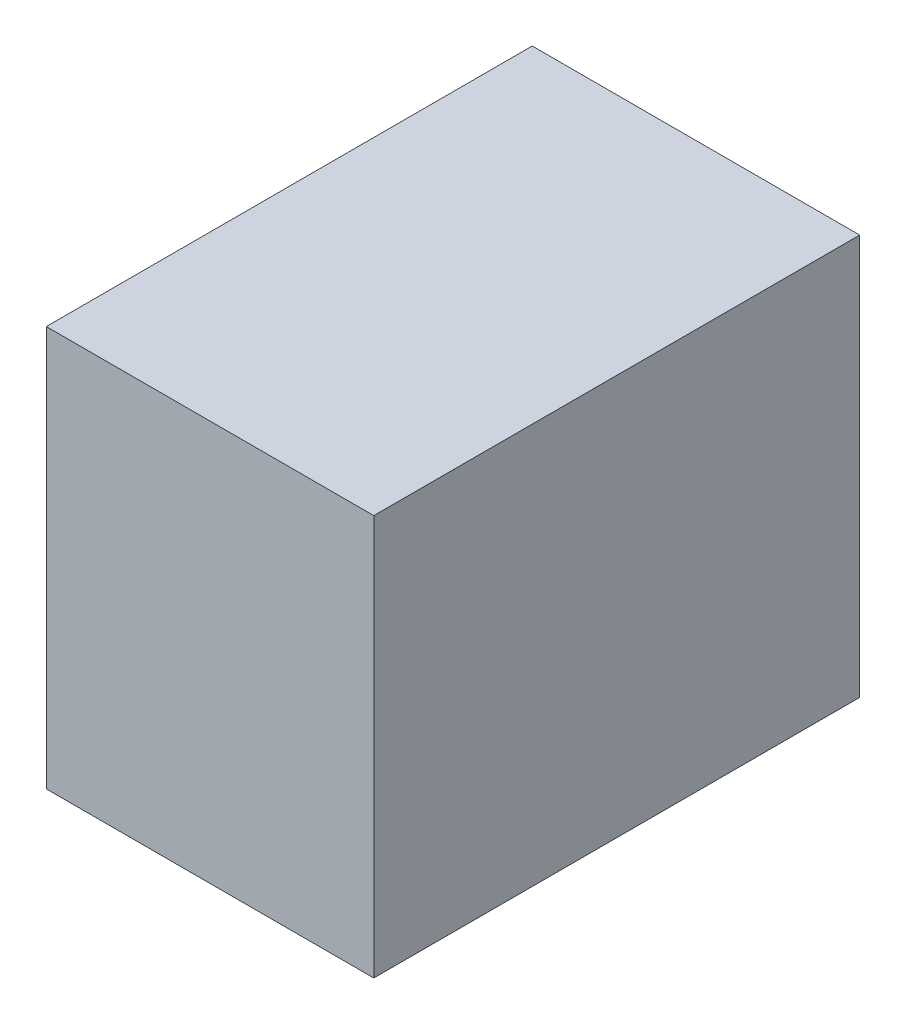
ISO-10303-21;
HEADER;
FILE_DESCRIPTION(('STEP AP214'),'2;1');
FILE_NAME('part.step','',(''),(''),'','','');
FILE_SCHEMA(('AUTOMOTIVE_DESIGN { 1 0 10303 214 1 1 1 1 }'));
ENDSEC;
DATA;
#1=APPLICATION_CONTEXT('core data for automotive mechanical design processes');
#2=APPLICATION_PROTOCOL_DEFINITION('international standard','automotive_design',2000,#1);
#3=PRODUCT_CONTEXT('',#1,'mechanical');
#4=PRODUCT('Part','Part','',(#3));
#5=PRODUCT_RELATED_PRODUCT_CATEGORY('part','',(#4));
#6=PRODUCT_DEFINITION_FORMATION('','',#4);
#7=PRODUCT_DEFINITION_CONTEXT('part definition',#1,'design');
#8=PRODUCT_DEFINITION('design','',#6,#7);
#9=PRODUCT_DEFINITION_SHAPE('','',#8);
#10=(LENGTH_UNIT() NAMED_UNIT(*) SI_UNIT(.MILLI.,.METRE.));
#11=(NAMED_UNIT(*) PLANE_ANGLE_UNIT() SI_UNIT($,.RADIAN.));
#12=(NAMED_UNIT(*) SI_UNIT($,.STERADIAN.) SOLID_ANGLE_UNIT());
#13=UNCERTAINTY_MEASURE_WITH_UNIT(LENGTH_MEASURE(1.E-05),#10,'distance_accuracy_value','');
#14=(GEOMETRIC_REPRESENTATION_CONTEXT(3) GLOBAL_UNCERTAINTY_ASSIGNED_CONTEXT((#13)) GLOBAL_UNIT_ASSIGNED_CONTEXT((#10,
#11,#12)) REPRESENTATION_CONTEXT('',''));
#15=CARTESIAN_POINT('',(0.,0.,0.));
#16=DIRECTION('',(0.,0.,1.));
#17=DIRECTION('',(1.,0.,0.));
#18=AXIS2_PLACEMENT_3D('',#15,#16,#17);
#19=CARTESIAN_POINT('',(-444.5,1087.12,659.60625));
#20=DIRECTION('',(1.,0.,0.));
#21=DIRECTION('',(0.,0.,-1.));
#22=AXIS2_PLACEMENT_3D('',#19,#20,#21);
#23=PLANE('',#22);
#24=DIRECTION('',(0.,0.,1.));
#25=VECTOR('',#24,1.);
#26=CARTESIAN_POINT('',(-444.5,0.,659.60625));
#27=LINE('',#26,#25);
#28=CARTESIAN_POINT('',(-444.5,0.,-659.60625));
#29=VERTEX_POINT('',#28);
#30=CARTESIAN_POINT('',(-444.5,0.,659.60625));
#31=VERTEX_POINT('',#30);
#32=EDGE_CURVE('E98',#29,#31,#27,.T.);
#33=ORIENTED_EDGE('',*,*,#32,.T.);
#34=DIRECTION('',(0.,-1.,0.));
#35=VECTOR('',#34,1.);
#36=CARTESIAN_POINT('',(-444.5,1087.12,659.60625));
#37=LINE('',#36,#35);
#38=CARTESIAN_POINT('',(-444.5,1087.12,659.60625));
#39=VERTEX_POINT('',#38);
#40=EDGE_CURVE('E11',#39,#31,#37,.T.);
#41=ORIENTED_EDGE('',*,*,#40,.F.);
#42=DIRECTION('',(0.,0.,1.));
#43=VECTOR('',#42,1.);
#44=CARTESIAN_POINT('',(-444.5,1087.12,659.60625));
#45=LINE('',#44,#43);
#46=CARTESIAN_POINT('',(-444.5,1087.12,-659.60625));
#47=VERTEX_POINT('',#46);
#48=EDGE_CURVE('E86',#47,#39,#45,.T.);
#49=ORIENTED_EDGE('',*,*,#48,.F.);
#50=DIRECTION('',(0.,-1.,0.));
#51=VECTOR('',#50,1.);
#52=CARTESIAN_POINT('',(-444.5,1087.12,-659.60625));
#53=LINE('',#52,#51);
#54=EDGE_CURVE('E94',#47,#29,#53,.T.);
#55=ORIENTED_EDGE('',*,*,#54,.T.);
#56=EDGE_LOOP('',(#33,#41,#49,#55));
#57=FACE_BOUND('',#56,.T.);
#58=ADVANCED_FACE('F35',(#57),#23,.F.);
#59=CARTESIAN_POINT('',(444.5,1087.12,659.60625));
#60=DIRECTION('',(0.,0.,-1.));
#61=DIRECTION('',(-1.,0.,0.));
#62=AXIS2_PLACEMENT_3D('',#59,#60,#61);
#63=PLANE('',#62);
#64=DIRECTION('',(1.,0.,0.));
#65=VECTOR('',#64,1.);
#66=CARTESIAN_POINT('',(444.5,0.,659.60625));
#67=LINE('',#66,#65);
#68=CARTESIAN_POINT('',(444.5,0.,659.60625));
#69=VERTEX_POINT('',#68);
#70=EDGE_CURVE('E90',#31,#69,#67,.T.);
#71=ORIENTED_EDGE('',*,*,#70,.T.);
#72=DIRECTION('',(0.,-1.,0.));
#73=VECTOR('',#72,1.);
#74=CARTESIAN_POINT('',(444.5,1087.12,659.60625));
#75=LINE('',#74,#73);
#76=CARTESIAN_POINT('',(444.5,1087.12,659.60625));
#77=VERTEX_POINT('',#76);
#78=EDGE_CURVE('E43',#77,#69,#75,.T.);
#79=ORIENTED_EDGE('',*,*,#78,.F.);
#80=DIRECTION('',(1.,0.,0.));
#81=VECTOR('',#80,1.);
#82=CARTESIAN_POINT('',(444.5,1087.12,659.60625));
#83=LINE('',#82,#81);
#84=EDGE_CURVE('E81',#39,#77,#83,.T.);
#85=ORIENTED_EDGE('',*,*,#84,.F.);
#86=ORIENTED_EDGE('',*,*,#40,.T.);
#87=EDGE_LOOP('',(#71,#79,#85,#86));
#88=FACE_BOUND('',#87,.T.);
#89=ADVANCED_FACE('F89',(#88),#63,.F.);
#90=CARTESIAN_POINT('',(444.5,1087.12,659.60625));
#91=DIRECTION('',(-1.,0.,0.));
#92=DIRECTION('',(0.,0.,1.));
#93=AXIS2_PLACEMENT_3D('',#90,#91,#92);
#94=PLANE('',#93);
#95=DIRECTION('',(0.,0.,-1.));
#96=VECTOR('',#95,1.);
#97=CARTESIAN_POINT('',(444.5,0.,659.60625));
#98=LINE('',#97,#96);
#99=CARTESIAN_POINT('',(444.5,0.,-659.60625));
#100=VERTEX_POINT('',#99);
#101=EDGE_CURVE('E68',#69,#100,#98,.T.);
#102=ORIENTED_EDGE('',*,*,#101,.T.);
#103=DIRECTION('',(0.,-1.,0.));
#104=VECTOR('',#103,1.);
#105=CARTESIAN_POINT('',(444.5,1087.12,-659.60625));
#106=LINE('',#105,#104);
#107=CARTESIAN_POINT('',(444.5,1087.12,-659.60625));
#108=VERTEX_POINT('',#107);
#109=EDGE_CURVE('E91',#108,#100,#106,.T.);
#110=ORIENTED_EDGE('',*,*,#109,.F.);
#111=DIRECTION('',(0.,0.,-1.));
#112=VECTOR('',#111,1.);
#113=CARTESIAN_POINT('',(444.5,1087.12,659.60625));
#114=LINE('',#113,#112);
#115=EDGE_CURVE('E84',#77,#108,#114,.T.);
#116=ORIENTED_EDGE('',*,*,#115,.F.);
#117=ORIENTED_EDGE('',*,*,#78,.T.);
#118=EDGE_LOOP('',(#102,#110,#116,#117));
#119=FACE_BOUND('',#118,.T.);
#120=ADVANCED_FACE('F92',(#119),#94,.F.);
#121=CARTESIAN_POINT('',(444.5,1087.12,-659.60625));
#122=DIRECTION('',(0.,0.,1.));
#123=DIRECTION('',(1.,0.,0.));
#124=AXIS2_PLACEMENT_3D('',#121,#122,#123);
#125=PLANE('',#124);
#126=DIRECTION('',(-1.,0.,0.));
#127=VECTOR('',#126,1.);
#128=CARTESIAN_POINT('',(444.5,0.,-659.60625));
#129=LINE('',#128,#127);
#130=EDGE_CURVE('E74',#100,#29,#129,.T.);
#131=ORIENTED_EDGE('',*,*,#130,.T.);
#132=ORIENTED_EDGE('',*,*,#54,.F.);
#133=DIRECTION('',(-1.,0.,0.));
#134=VECTOR('',#133,1.);
#135=CARTESIAN_POINT('',(444.5,1087.12,-659.60625));
#136=LINE('',#135,#134);
#137=EDGE_CURVE('E51',#108,#47,#136,.T.);
#138=ORIENTED_EDGE('',*,*,#137,.F.);
#139=ORIENTED_EDGE('',*,*,#109,.T.);
#140=EDGE_LOOP('',(#131,#132,#138,#139));
#141=FACE_BOUND('',#140,.T.);
#142=ADVANCED_FACE('F105',(#141),#125,.F.);
#143=CARTESIAN_POINT('',(0.,1087.12,0.));
#144=DIRECTION('',(0.,1.,0.));
#145=DIRECTION('',(0.,0.,1.));
#146=AXIS2_PLACEMENT_3D('',#143,#144,#145);
#147=PLANE('',#146);
#148=ORIENTED_EDGE('',*,*,#48,.T.);
#149=ORIENTED_EDGE('',*,*,#84,.T.);
#150=ORIENTED_EDGE('',*,*,#115,.T.);
#151=ORIENTED_EDGE('',*,*,#137,.T.);
#152=EDGE_LOOP('',(#148,#149,#150,#151));
#153=FACE_BOUND('',#152,.T.);
#154=ADVANCED_FACE('F82',(#153),#147,.T.);
#155=CARTESIAN_POINT('',(0.,0.,0.));
#156=DIRECTION('',(0.,1.,0.));
#157=DIRECTION('',(0.,0.,1.));
#158=AXIS2_PLACEMENT_3D('',#155,#156,#157);
#159=PLANE('',#158);
#160=ORIENTED_EDGE('',*,*,#32,.F.);
#161=ORIENTED_EDGE('',*,*,#130,.F.);
#162=ORIENTED_EDGE('',*,*,#101,.F.);
#163=ORIENTED_EDGE('',*,*,#70,.F.);
#164=EDGE_LOOP('',(#160,#161,#162,#163));
#165=FACE_BOUND('',#164,.T.);
#166=ADVANCED_FACE('F108',(#165),#159,.F.);
#167=CLOSED_SHELL('',(#58,#89,#120,#142,#154,#166));
#168=MANIFOLD_SOLID_BREP('B2',#167);
#169=ADVANCED_BREP_SHAPE_REPRESENTATION('',(#18,#168),#14);
#170=SHAPE_DEFINITION_REPRESENTATION(#9,#169);
ENDSEC;
END-ISO-10303-21;
